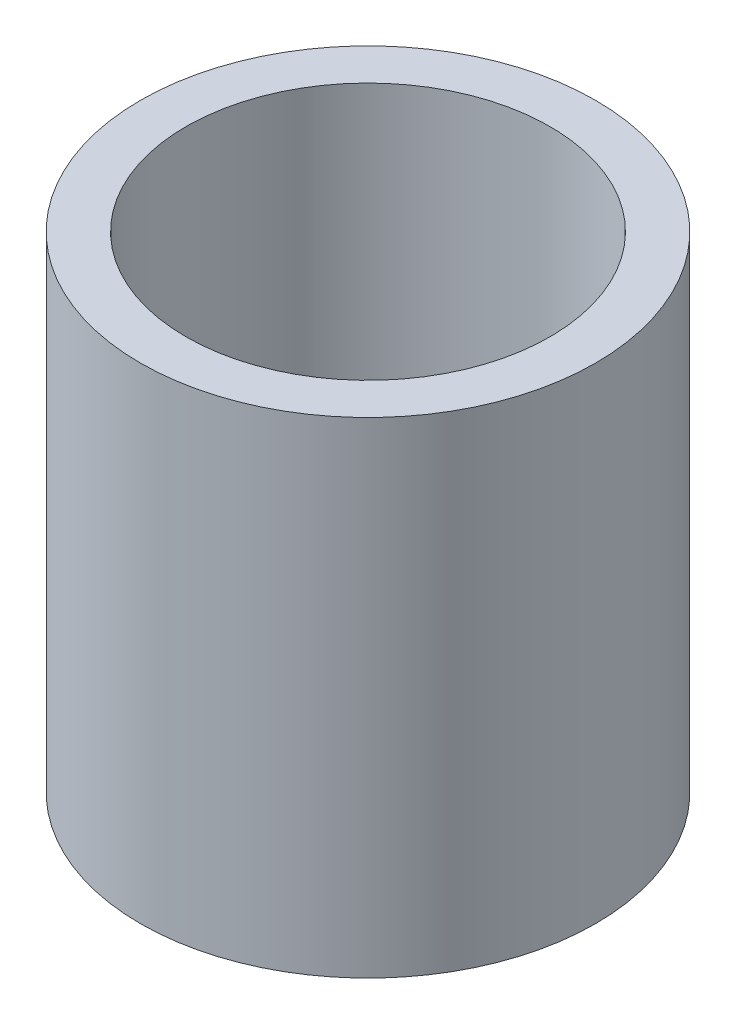
ISO-10303-21;
HEADER;
FILE_DESCRIPTION(('STEP AP214'),'2;1');
FILE_NAME('part.step','',(''),(''),'','','');
FILE_SCHEMA(('AUTOMOTIVE_DESIGN { 1 0 10303 214 1 1 1 1 }'));
ENDSEC;
DATA;
#1=APPLICATION_CONTEXT('core data for automotive mechanical design processes');
#2=APPLICATION_PROTOCOL_DEFINITION('international standard','automotive_design',2000,#1);
#3=PRODUCT_CONTEXT('',#1,'mechanical');
#4=PRODUCT('Part','Part','',(#3));
#5=PRODUCT_RELATED_PRODUCT_CATEGORY('part','',(#4));
#6=PRODUCT_DEFINITION_FORMATION('','',#4);
#7=PRODUCT_DEFINITION_CONTEXT('part definition',#1,'design');
#8=PRODUCT_DEFINITION('design','',#6,#7);
#9=PRODUCT_DEFINITION_SHAPE('','',#8);
#10=(LENGTH_UNIT() NAMED_UNIT(*) SI_UNIT(.MILLI.,.METRE.));
#11=(NAMED_UNIT(*) PLANE_ANGLE_UNIT() SI_UNIT($,.RADIAN.));
#12=(NAMED_UNIT(*) SI_UNIT($,.STERADIAN.) SOLID_ANGLE_UNIT());
#13=UNCERTAINTY_MEASURE_WITH_UNIT(LENGTH_MEASURE(1.E-05),#10,'distance_accuracy_value','');
#14=(GEOMETRIC_REPRESENTATION_CONTEXT(3) GLOBAL_UNCERTAINTY_ASSIGNED_CONTEXT((#13)) GLOBAL_UNIT_ASSIGNED_CONTEXT((#10,
#11,#12)) REPRESENTATION_CONTEXT('',''));
#15=CARTESIAN_POINT('',(0.,0.,0.));
#16=DIRECTION('',(0.,0.,1.));
#17=DIRECTION('',(1.,0.,0.));
#18=AXIS2_PLACEMENT_3D('',#15,#16,#17);
#19=CARTESIAN_POINT('',(0.,25.4,0.));
#20=DIRECTION('',(0.,1.,0.));
#21=DIRECTION('',(0.,0.,1.));
#22=AXIS2_PLACEMENT_3D('',#19,#20,#21);
#23=PLANE('',#22);
#24=CARTESIAN_POINT('',(0.,25.4,0.));
#25=DIRECTION('',(0.,1.,0.));
#26=DIRECTION('',(0.,0.,1.));
#27=AXIS2_PLACEMENT_3D('',#24,#25,#26);
#28=CIRCLE('',#27,11.90625);
#29=CARTESIAN_POINT('',(0.,25.4,11.90625));
#30=VERTEX_POINT('',#29);
#31=EDGE_CURVE('E10',#30,#30,#28,.T.);
#32=ORIENTED_EDGE('',*,*,#31,.T.);
#33=EDGE_LOOP('',(#32));
#34=FACE_BOUND('',#33,.T.);
#35=CARTESIAN_POINT('',(0.,25.4,0.));
#36=DIRECTION('',(0.,1.,0.));
#37=DIRECTION('',(0.,0.,1.));
#38=AXIS2_PLACEMENT_3D('',#35,#36,#37);
#39=CIRCLE('',#38,9.525);
#40=CARTESIAN_POINT('',(0.,25.4,9.525));
#41=VERTEX_POINT('',#40);
#42=EDGE_CURVE('E26',#41,#41,#39,.T.);
#43=ORIENTED_EDGE('',*,*,#42,.F.);
#44=EDGE_LOOP('',(#43));
#45=FACE_BOUND('',#44,.T.);
#46=ADVANCED_FACE('F15',(#34,#45),#23,.T.);
#47=CARTESIAN_POINT('',(0.,0.,0.));
#48=DIRECTION('',(0.,1.,0.));
#49=DIRECTION('',(0.,0.,1.));
#50=AXIS2_PLACEMENT_3D('',#47,#48,#49);
#51=PLANE('',#50);
#52=CARTESIAN_POINT('',(0.,0.,0.));
#53=DIRECTION('',(0.,1.,0.));
#54=DIRECTION('',(0.,0.,1.));
#55=AXIS2_PLACEMENT_3D('',#52,#53,#54);
#56=CIRCLE('',#55,11.90625);
#57=CARTESIAN_POINT('',(0.,0.,11.90625));
#58=VERTEX_POINT('',#57);
#59=EDGE_CURVE('E19',#58,#58,#56,.T.);
#60=ORIENTED_EDGE('',*,*,#59,.F.);
#61=EDGE_LOOP('',(#60));
#62=FACE_BOUND('',#61,.T.);
#63=CARTESIAN_POINT('',(0.,0.,0.));
#64=DIRECTION('',(0.,1.,0.));
#65=DIRECTION('',(0.,0.,1.));
#66=AXIS2_PLACEMENT_3D('',#63,#64,#65);
#67=CIRCLE('',#66,9.525);
#68=CARTESIAN_POINT('',(0.,0.,9.525));
#69=VERTEX_POINT('',#68);
#70=EDGE_CURVE('E28',#69,#69,#67,.T.);
#71=ORIENTED_EDGE('',*,*,#70,.T.);
#72=EDGE_LOOP('',(#71));
#73=FACE_BOUND('',#72,.T.);
#74=ADVANCED_FACE('F38',(#62,#73),#51,.F.);
#75=CARTESIAN_POINT('',(0.,25.4,0.));
#76=DIRECTION('',(0.,-1.,0.));
#77=DIRECTION('',(0.,0.,-1.));
#78=AXIS2_PLACEMENT_3D('',#75,#76,#77);
#79=CYLINDRICAL_SURFACE('',#78,11.90625);
#80=ORIENTED_EDGE('',*,*,#31,.F.);
#81=EDGE_LOOP('',(#80));
#82=FACE_BOUND('',#81,.T.);
#83=ORIENTED_EDGE('',*,*,#59,.T.);
#84=EDGE_LOOP('',(#83));
#85=FACE_BOUND('',#84,.T.);
#86=ADVANCED_FACE('F17',(#82,#85),#79,.T.);
#87=CARTESIAN_POINT('',(0.,25.4,0.));
#88=DIRECTION('',(0.,-1.,0.));
#89=DIRECTION('',(0.,0.,-1.));
#90=AXIS2_PLACEMENT_3D('',#87,#88,#89);
#91=CYLINDRICAL_SURFACE('',#90,9.525);
#92=ORIENTED_EDGE('',*,*,#42,.T.);
#93=EDGE_LOOP('',(#92));
#94=FACE_BOUND('',#93,.T.);
#95=ORIENTED_EDGE('',*,*,#70,.F.);
#96=EDGE_LOOP('',(#95));
#97=FACE_BOUND('',#96,.T.);
#98=ADVANCED_FACE('F34',(#94,#97),#91,.F.);
#99=CLOSED_SHELL('',(#46,#74,#86,#98));
#100=MANIFOLD_SOLID_BREP('B1',#99);
#101=ADVANCED_BREP_SHAPE_REPRESENTATION('',(#18,#100),#14);
#102=SHAPE_DEFINITION_REPRESENTATION(#9,#101);
ENDSEC;
END-ISO-10303-21;
